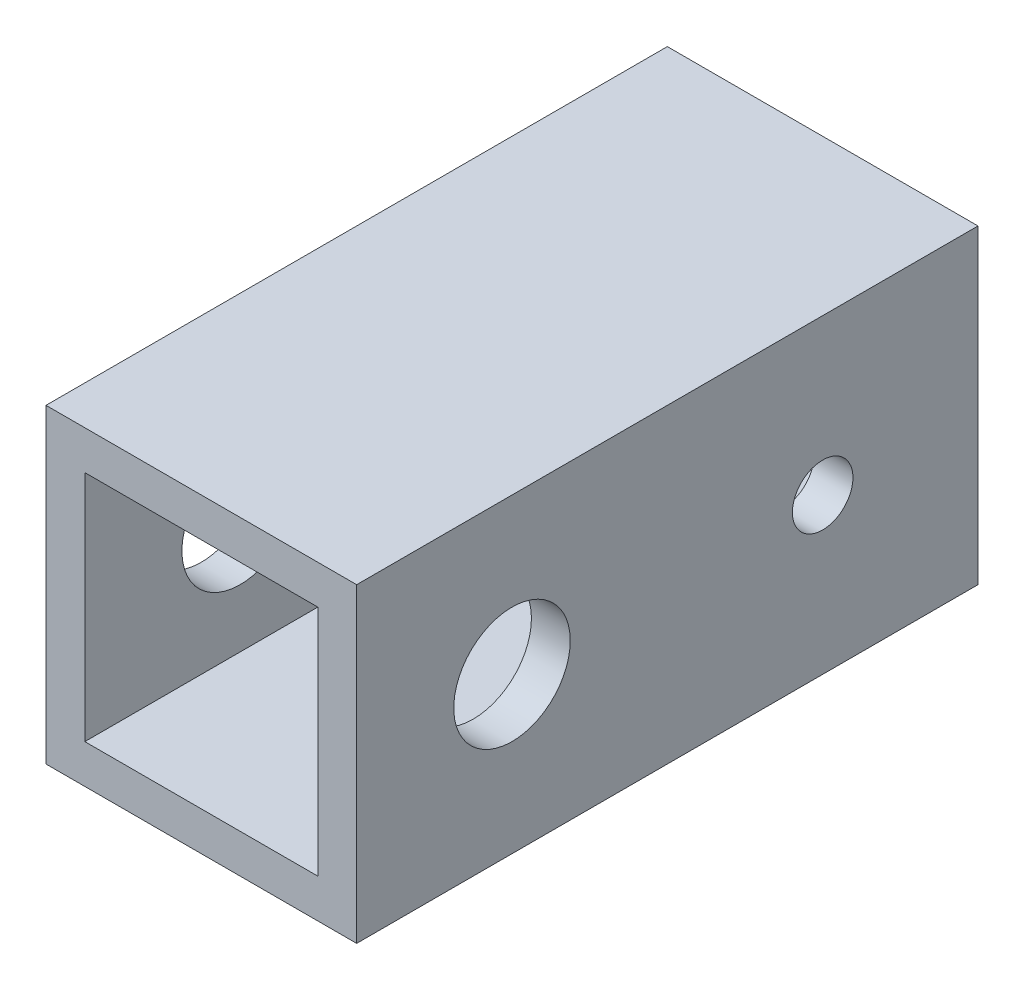
ISO-10303-21;
HEADER;
FILE_DESCRIPTION(('STEP AP214'),'2;1');
FILE_NAME('part.step','',(''),(''),'','','');
FILE_SCHEMA(('AUTOMOTIVE_DESIGN { 1 0 10303 214 1 1 1 1 }'));
ENDSEC;
DATA;
#1=APPLICATION_CONTEXT('core data for automotive mechanical design processes');
#2=APPLICATION_PROTOCOL_DEFINITION('international standard','automotive_design',2000,#1);
#3=PRODUCT_CONTEXT('',#1,'mechanical');
#4=PRODUCT('Part','Part','',(#3));
#5=PRODUCT_RELATED_PRODUCT_CATEGORY('part','',(#4));
#6=PRODUCT_DEFINITION_FORMATION('','',#4);
#7=PRODUCT_DEFINITION_CONTEXT('part definition',#1,'design');
#8=PRODUCT_DEFINITION('design','',#6,#7);
#9=PRODUCT_DEFINITION_SHAPE('','',#8);
#10=(LENGTH_UNIT() NAMED_UNIT(*) SI_UNIT(.MILLI.,.METRE.));
#11=(NAMED_UNIT(*) PLANE_ANGLE_UNIT() SI_UNIT($,.RADIAN.));
#12=(NAMED_UNIT(*) SI_UNIT($,.STERADIAN.) SOLID_ANGLE_UNIT());
#13=UNCERTAINTY_MEASURE_WITH_UNIT(LENGTH_MEASURE(1.E-05),#10,'distance_accuracy_value','');
#14=(GEOMETRIC_REPRESENTATION_CONTEXT(3) GLOBAL_UNCERTAINTY_ASSIGNED_CONTEXT((#13)) GLOBAL_UNIT_ASSIGNED_CONTEXT((#10,
#11,#12)) REPRESENTATION_CONTEXT('',''));
#15=CARTESIAN_POINT('',(0.,0.,0.));
#16=DIRECTION('',(0.,0.,1.));
#17=DIRECTION('',(1.,0.,0.));
#18=AXIS2_PLACEMENT_3D('',#15,#16,#17);
#19=CARTESIAN_POINT('',(0.,0.,50.8));
#20=DIRECTION('',(0.,0.,1.));
#21=DIRECTION('',(1.,0.,0.));
#22=AXIS2_PLACEMENT_3D('',#19,#20,#21);
#23=PLANE('',#22);
#24=DIRECTION('',(0.,1.,0.));
#25=VECTOR('',#24,1.);
#26=CARTESIAN_POINT('',(12.7,-12.7,50.8));
#27=LINE('',#26,#25);
#28=CARTESIAN_POINT('',(12.7,-12.7,50.8));
#29=VERTEX_POINT('',#28);
#30=CARTESIAN_POINT('',(12.7,12.7,50.8));
#31=VERTEX_POINT('',#30);
#32=EDGE_CURVE('E164',#29,#31,#27,.T.);
#33=ORIENTED_EDGE('',*,*,#32,.T.);
#34=DIRECTION('',(-1.,0.,0.));
#35=VECTOR('',#34,1.);
#36=CARTESIAN_POINT('',(-12.7,12.7,50.8));
#37=LINE('',#36,#35);
#38=CARTESIAN_POINT('',(-12.7,12.7,50.8));
#39=VERTEX_POINT('',#38);
#40=EDGE_CURVE('E167',#31,#39,#37,.T.);
#41=ORIENTED_EDGE('',*,*,#40,.T.);
#42=DIRECTION('',(0.,-1.,0.));
#43=VECTOR('',#42,1.);
#44=CARTESIAN_POINT('',(-12.7,-12.7,50.8));
#45=LINE('',#44,#43);
#46=CARTESIAN_POINT('',(-12.7,-12.7,50.8));
#47=VERTEX_POINT('',#46);
#48=EDGE_CURVE('E170',#39,#47,#45,.T.);
#49=ORIENTED_EDGE('',*,*,#48,.T.);
#50=DIRECTION('',(1.,0.,0.));
#51=VECTOR('',#50,1.);
#52=CARTESIAN_POINT('',(-12.7,-12.7,50.8));
#53=LINE('',#52,#51);
#54=EDGE_CURVE('E172',#47,#29,#53,.T.);
#55=ORIENTED_EDGE('',*,*,#54,.T.);
#56=EDGE_LOOP('',(#33,#41,#49,#55));
#57=FACE_BOUND('',#56,.T.);
#58=DIRECTION('',(-1.,0.,0.));
#59=VECTOR('',#58,1.);
#60=CARTESIAN_POINT('',(0.,9.525,50.8));
#61=LINE('',#60,#59);
#62=CARTESIAN_POINT('',(9.525,9.525,50.8));
#63=VERTEX_POINT('',#62);
#64=CARTESIAN_POINT('',(-9.525,9.525,50.8));
#65=VERTEX_POINT('',#64);
#66=EDGE_CURVE('E134',#63,#65,#61,.T.);
#67=ORIENTED_EDGE('',*,*,#66,.F.);
#68=DIRECTION('',(0.,1.,0.));
#69=VECTOR('',#68,1.);
#70=CARTESIAN_POINT('',(9.525,0.,50.8));
#71=LINE('',#70,#69);
#72=CARTESIAN_POINT('',(9.525,-9.525,50.8));
#73=VERTEX_POINT('',#72);
#74=EDGE_CURVE('E126',#73,#63,#71,.T.);
#75=ORIENTED_EDGE('',*,*,#74,.F.);
#76=DIRECTION('',(1.,0.,0.));
#77=VECTOR('',#76,1.);
#78=CARTESIAN_POINT('',(0.,-9.525,50.8));
#79=LINE('',#78,#77);
#80=CARTESIAN_POINT('',(-9.525,-9.525,50.8));
#81=VERTEX_POINT('',#80);
#82=EDGE_CURVE('E148',#81,#73,#79,.T.);
#83=ORIENTED_EDGE('',*,*,#82,.F.);
#84=DIRECTION('',(0.,-1.,0.));
#85=VECTOR('',#84,1.);
#86=CARTESIAN_POINT('',(-9.525,0.,50.8));
#87=LINE('',#86,#85);
#88=EDGE_CURVE('E146',#65,#81,#87,.T.);
#89=ORIENTED_EDGE('',*,*,#88,.F.);
#90=EDGE_LOOP('',(#67,#75,#83,#89));
#91=FACE_BOUND('',#90,.T.);
#92=ADVANCED_FACE('F59',(#57,#91),#23,.T.);
#93=CARTESIAN_POINT('',(0.,0.,0.));
#94=DIRECTION('',(0.,0.,1.));
#95=DIRECTION('',(1.,0.,0.));
#96=AXIS2_PLACEMENT_3D('',#93,#94,#95);
#97=PLANE('',#96);
#98=DIRECTION('',(0.,1.,0.));
#99=VECTOR('',#98,1.);
#100=CARTESIAN_POINT('',(12.7,-12.7,0.));
#101=LINE('',#100,#99);
#102=CARTESIAN_POINT('',(12.7,-12.7,0.));
#103=VERTEX_POINT('',#102);
#104=CARTESIAN_POINT('',(12.7,12.7,0.));
#105=VERTEX_POINT('',#104);
#106=EDGE_CURVE('E142',#103,#105,#101,.T.);
#107=ORIENTED_EDGE('',*,*,#106,.F.);
#108=DIRECTION('',(1.,0.,0.));
#109=VECTOR('',#108,1.);
#110=CARTESIAN_POINT('',(-12.7,-12.7,0.));
#111=LINE('',#110,#109);
#112=CARTESIAN_POINT('',(-12.7,-12.7,0.));
#113=VERTEX_POINT('',#112);
#114=EDGE_CURVE('E168',#113,#103,#111,.T.);
#115=ORIENTED_EDGE('',*,*,#114,.F.);
#116=DIRECTION('',(0.,-1.,0.));
#117=VECTOR('',#116,1.);
#118=CARTESIAN_POINT('',(-12.7,-12.7,0.));
#119=LINE('',#118,#117);
#120=CARTESIAN_POINT('',(-12.7,12.7,0.));
#121=VERTEX_POINT('',#120);
#122=EDGE_CURVE('E179',#121,#113,#119,.T.);
#123=ORIENTED_EDGE('',*,*,#122,.F.);
#124=DIRECTION('',(-1.,0.,0.));
#125=VECTOR('',#124,1.);
#126=CARTESIAN_POINT('',(-12.7,12.7,0.));
#127=LINE('',#126,#125);
#128=EDGE_CURVE('E177',#105,#121,#127,.T.);
#129=ORIENTED_EDGE('',*,*,#128,.F.);
#130=EDGE_LOOP('',(#107,#115,#123,#129));
#131=FACE_BOUND('',#130,.T.);
#132=DIRECTION('',(0.,1.,0.));
#133=VECTOR('',#132,1.);
#134=CARTESIAN_POINT('',(9.525,0.,0.));
#135=LINE('',#134,#133);
#136=CARTESIAN_POINT('',(9.525,-9.525,0.));
#137=VERTEX_POINT('',#136);
#138=CARTESIAN_POINT('',(9.525,9.525,0.));
#139=VERTEX_POINT('',#138);
#140=EDGE_CURVE('E84',#137,#139,#135,.T.);
#141=ORIENTED_EDGE('',*,*,#140,.T.);
#142=DIRECTION('',(-1.,0.,0.));
#143=VECTOR('',#142,1.);
#144=CARTESIAN_POINT('',(0.,9.525,0.));
#145=LINE('',#144,#143);
#146=CARTESIAN_POINT('',(-9.525,9.525,0.));
#147=VERTEX_POINT('',#146);
#148=EDGE_CURVE('E141',#139,#147,#145,.T.);
#149=ORIENTED_EDGE('',*,*,#148,.T.);
#150=DIRECTION('',(0.,-1.,0.));
#151=VECTOR('',#150,1.);
#152=CARTESIAN_POINT('',(-9.525,0.,0.));
#153=LINE('',#152,#151);
#154=CARTESIAN_POINT('',(-9.525,-9.525,0.));
#155=VERTEX_POINT('',#154);
#156=EDGE_CURVE('E156',#147,#155,#153,.T.);
#157=ORIENTED_EDGE('',*,*,#156,.T.);
#158=DIRECTION('',(1.,0.,0.));
#159=VECTOR('',#158,1.);
#160=CARTESIAN_POINT('',(0.,-9.525,0.));
#161=LINE('',#160,#159);
#162=EDGE_CURVE('E135',#155,#137,#161,.T.);
#163=ORIENTED_EDGE('',*,*,#162,.T.);
#164=EDGE_LOOP('',(#141,#149,#157,#163));
#165=FACE_BOUND('',#164,.T.);
#166=ADVANCED_FACE('F226',(#131,#165),#97,.F.);
#167=CARTESIAN_POINT('',(12.7,-12.7,50.8));
#168=DIRECTION('',(-1.,0.,0.));
#169=DIRECTION('',(0.,0.,1.));
#170=AXIS2_PLACEMENT_3D('',#167,#168,#169);
#171=PLANE('',#170);
#172=CARTESIAN_POINT('',(12.7,0.,38.1));
#173=DIRECTION('',(1.,0.,0.));
#174=DIRECTION('',(0.,0.,-1.));
#175=AXIS2_PLACEMENT_3D('',#172,#173,#174);
#176=CIRCLE('',#175,4.7625);
#177=CARTESIAN_POINT('',(12.7,0.,33.3375));
#178=VERTEX_POINT('',#177);
#179=EDGE_CURVE('E197',#178,#178,#176,.T.);
#180=ORIENTED_EDGE('',*,*,#179,.F.);
#181=EDGE_LOOP('',(#180));
#182=FACE_BOUND('',#181,.T.);
#183=CARTESIAN_POINT('',(12.7,0.,12.7));
#184=DIRECTION('',(1.,0.,0.));
#185=DIRECTION('',(0.,0.,-1.));
#186=AXIS2_PLACEMENT_3D('',#183,#184,#185);
#187=CIRCLE('',#186,2.4765);
#188=CARTESIAN_POINT('',(12.7,0.,10.2235));
#189=VERTEX_POINT('',#188);
#190=EDGE_CURVE('E207',#189,#189,#187,.T.);
#191=ORIENTED_EDGE('',*,*,#190,.F.);
#192=EDGE_LOOP('',(#191));
#193=FACE_BOUND('',#192,.T.);
#194=ORIENTED_EDGE('',*,*,#106,.T.);
#195=DIRECTION('',(0.,0.,-1.));
#196=VECTOR('',#195,1.);
#197=CARTESIAN_POINT('',(12.7,12.7,50.8));
#198=LINE('',#197,#196);
#199=EDGE_CURVE('E12',#31,#105,#198,.T.);
#200=ORIENTED_EDGE('',*,*,#199,.F.);
#201=ORIENTED_EDGE('',*,*,#32,.F.);
#202=DIRECTION('',(0.,0.,-1.));
#203=VECTOR('',#202,1.);
#204=CARTESIAN_POINT('',(12.7,-12.7,50.8));
#205=LINE('',#204,#203);
#206=EDGE_CURVE('E174',#29,#103,#205,.T.);
#207=ORIENTED_EDGE('',*,*,#206,.T.);
#208=EDGE_LOOP('',(#194,#200,#201,#207));
#209=FACE_BOUND('',#208,.T.);
#210=ADVANCED_FACE('F61',(#182,#193,#209),#171,.F.);
#211=CARTESIAN_POINT('',(-12.7,12.7,50.8));
#212=DIRECTION('',(0.,-1.,0.));
#213=DIRECTION('',(0.,0.,-1.));
#214=AXIS2_PLACEMENT_3D('',#211,#212,#213);
#215=PLANE('',#214);
#216=ORIENTED_EDGE('',*,*,#128,.T.);
#217=DIRECTION('',(0.,0.,-1.));
#218=VECTOR('',#217,1.);
#219=CARTESIAN_POINT('',(-12.7,12.7,50.8));
#220=LINE('',#219,#218);
#221=EDGE_CURVE('E68',#39,#121,#220,.T.);
#222=ORIENTED_EDGE('',*,*,#221,.F.);
#223=ORIENTED_EDGE('',*,*,#40,.F.);
#224=ORIENTED_EDGE('',*,*,#199,.T.);
#225=EDGE_LOOP('',(#216,#222,#223,#224));
#226=FACE_BOUND('',#225,.T.);
#227=ADVANCED_FACE('F252',(#226),#215,.F.);
#228=CARTESIAN_POINT('',(-12.7,-12.7,50.8));
#229=DIRECTION('',(1.,0.,0.));
#230=DIRECTION('',(0.,0.,-1.));
#231=AXIS2_PLACEMENT_3D('',#228,#229,#230);
#232=PLANE('',#231);
#233=CARTESIAN_POINT('',(-12.7,0.,38.1));
#234=DIRECTION('',(1.,0.,0.));
#235=DIRECTION('',(0.,0.,-1.));
#236=AXIS2_PLACEMENT_3D('',#233,#234,#235);
#237=CIRCLE('',#236,4.7625);
#238=CARTESIAN_POINT('',(-12.7,0.,33.3375));
#239=VERTEX_POINT('',#238);
#240=EDGE_CURVE('E191',#239,#239,#237,.T.);
#241=ORIENTED_EDGE('',*,*,#240,.T.);
#242=EDGE_LOOP('',(#241));
#243=FACE_BOUND('',#242,.T.);
#244=CARTESIAN_POINT('',(-12.7,0.,12.7));
#245=DIRECTION('',(1.,0.,0.));
#246=DIRECTION('',(0.,0.,-1.));
#247=AXIS2_PLACEMENT_3D('',#244,#245,#246);
#248=CIRCLE('',#247,2.4765);
#249=CARTESIAN_POINT('',(-12.7,0.,10.2235));
#250=VERTEX_POINT('',#249);
#251=EDGE_CURVE('E202',#250,#250,#248,.T.);
#252=ORIENTED_EDGE('',*,*,#251,.T.);
#253=EDGE_LOOP('',(#252));
#254=FACE_BOUND('',#253,.T.);
#255=ORIENTED_EDGE('',*,*,#122,.T.);
#256=DIRECTION('',(0.,0.,-1.));
#257=VECTOR('',#256,1.);
#258=CARTESIAN_POINT('',(-12.7,-12.7,50.8));
#259=LINE('',#258,#257);
#260=EDGE_CURVE('E184',#47,#113,#259,.T.);
#261=ORIENTED_EDGE('',*,*,#260,.F.);
#262=ORIENTED_EDGE('',*,*,#48,.F.);
#263=ORIENTED_EDGE('',*,*,#221,.T.);
#264=EDGE_LOOP('',(#255,#261,#262,#263));
#265=FACE_BOUND('',#264,.T.);
#266=ADVANCED_FACE('F249',(#243,#254,#265),#232,.F.);
#267=CARTESIAN_POINT('',(-12.7,-12.7,50.8));
#268=DIRECTION('',(0.,1.,0.));
#269=DIRECTION('',(0.,0.,1.));
#270=AXIS2_PLACEMENT_3D('',#267,#268,#269);
#271=PLANE('',#270);
#272=ORIENTED_EDGE('',*,*,#114,.T.);
#273=ORIENTED_EDGE('',*,*,#206,.F.);
#274=ORIENTED_EDGE('',*,*,#54,.F.);
#275=ORIENTED_EDGE('',*,*,#260,.T.);
#276=EDGE_LOOP('',(#272,#273,#274,#275));
#277=FACE_BOUND('',#276,.T.);
#278=ADVANCED_FACE('F246',(#277),#271,.F.);
#279=CARTESIAN_POINT('',(9.525,0.,50.8));
#280=DIRECTION('',(-1.,0.,0.));
#281=DIRECTION('',(0.,0.,1.));
#282=AXIS2_PLACEMENT_3D('',#279,#280,#281);
#283=PLANE('',#282);
#284=CARTESIAN_POINT('',(9.525,0.,38.1));
#285=DIRECTION('',(-1.,0.,0.));
#286=DIRECTION('',(0.,0.,1.));
#287=AXIS2_PLACEMENT_3D('',#284,#285,#286);
#288=CIRCLE('',#287,4.7625);
#289=CARTESIAN_POINT('',(9.525,0.,42.8625));
#290=VERTEX_POINT('',#289);
#291=EDGE_CURVE('E154',#290,#290,#288,.T.);
#292=ORIENTED_EDGE('',*,*,#291,.F.);
#293=EDGE_LOOP('',(#292));
#294=FACE_BOUND('',#293,.T.);
#295=CARTESIAN_POINT('',(9.525,0.,12.7));
#296=DIRECTION('',(-1.,0.,0.));
#297=DIRECTION('',(0.,0.,1.));
#298=AXIS2_PLACEMENT_3D('',#295,#296,#297);
#299=CIRCLE('',#298,2.4765);
#300=CARTESIAN_POINT('',(9.525,0.,15.1765));
#301=VERTEX_POINT('',#300);
#302=EDGE_CURVE('E190',#301,#301,#299,.T.);
#303=ORIENTED_EDGE('',*,*,#302,.F.);
#304=EDGE_LOOP('',(#303));
#305=FACE_BOUND('',#304,.T.);
#306=ORIENTED_EDGE('',*,*,#140,.F.);
#307=DIRECTION('',(0.,0.,-1.));
#308=VECTOR('',#307,1.);
#309=CARTESIAN_POINT('',(9.525,-9.525,50.8));
#310=LINE('',#309,#308);
#311=EDGE_CURVE('E130',#73,#137,#310,.T.);
#312=ORIENTED_EDGE('',*,*,#311,.F.);
#313=ORIENTED_EDGE('',*,*,#74,.T.);
#314=DIRECTION('',(0.,0.,-1.));
#315=VECTOR('',#314,1.);
#316=CARTESIAN_POINT('',(9.525,9.525,50.8));
#317=LINE('',#316,#315);
#318=EDGE_CURVE('E129',#63,#139,#317,.T.);
#319=ORIENTED_EDGE('',*,*,#318,.T.);
#320=EDGE_LOOP('',(#306,#312,#313,#319));
#321=FACE_BOUND('',#320,.T.);
#322=ADVANCED_FACE('F128',(#294,#305,#321),#283,.T.);
#323=CARTESIAN_POINT('',(0.,9.525,50.8));
#324=DIRECTION('',(0.,-1.,0.));
#325=DIRECTION('',(0.,0.,-1.));
#326=AXIS2_PLACEMENT_3D('',#323,#324,#325);
#327=PLANE('',#326);
#328=ORIENTED_EDGE('',*,*,#148,.F.);
#329=ORIENTED_EDGE('',*,*,#318,.F.);
#330=ORIENTED_EDGE('',*,*,#66,.T.);
#331=DIRECTION('',(0.,0.,-1.));
#332=VECTOR('',#331,1.);
#333=CARTESIAN_POINT('',(-9.525,9.525,50.8));
#334=LINE('',#333,#332);
#335=EDGE_CURVE('E143',#65,#147,#334,.T.);
#336=ORIENTED_EDGE('',*,*,#335,.T.);
#337=EDGE_LOOP('',(#328,#329,#330,#336));
#338=FACE_BOUND('',#337,.T.);
#339=ADVANCED_FACE('F138',(#338),#327,.T.);
#340=CARTESIAN_POINT('',(-9.525,0.,50.8));
#341=DIRECTION('',(1.,0.,0.));
#342=DIRECTION('',(0.,0.,-1.));
#343=AXIS2_PLACEMENT_3D('',#340,#341,#342);
#344=PLANE('',#343);
#345=CARTESIAN_POINT('',(-9.525,0.,38.1));
#346=DIRECTION('',(1.,0.,0.));
#347=DIRECTION('',(0.,0.,-1.));
#348=AXIS2_PLACEMENT_3D('',#345,#346,#347);
#349=CIRCLE('',#348,4.7625);
#350=CARTESIAN_POINT('',(-9.525,0.,33.3375));
#351=VERTEX_POINT('',#350);
#352=EDGE_CURVE('E63',#351,#351,#349,.T.);
#353=ORIENTED_EDGE('',*,*,#352,.F.);
#354=EDGE_LOOP('',(#353));
#355=FACE_BOUND('',#354,.T.);
#356=CARTESIAN_POINT('',(-9.525,0.,12.7));
#357=DIRECTION('',(1.,0.,0.));
#358=DIRECTION('',(0.,0.,-1.));
#359=AXIS2_PLACEMENT_3D('',#356,#357,#358);
#360=CIRCLE('',#359,2.4765);
#361=CARTESIAN_POINT('',(-9.525,0.,10.2235));
#362=VERTEX_POINT('',#361);
#363=EDGE_CURVE('E188',#362,#362,#360,.T.);
#364=ORIENTED_EDGE('',*,*,#363,.F.);
#365=EDGE_LOOP('',(#364));
#366=FACE_BOUND('',#365,.T.);
#367=ORIENTED_EDGE('',*,*,#156,.F.);
#368=ORIENTED_EDGE('',*,*,#335,.F.);
#369=ORIENTED_EDGE('',*,*,#88,.T.);
#370=DIRECTION('',(0.,0.,-1.));
#371=VECTOR('',#370,1.);
#372=CARTESIAN_POINT('',(-9.525,-9.525,50.8));
#373=LINE('',#372,#371);
#374=EDGE_CURVE('E76',#81,#155,#373,.T.);
#375=ORIENTED_EDGE('',*,*,#374,.T.);
#376=EDGE_LOOP('',(#367,#368,#369,#375));
#377=FACE_BOUND('',#376,.T.);
#378=ADVANCED_FACE('F218',(#355,#366,#377),#344,.T.);
#379=CARTESIAN_POINT('',(0.,-9.525,50.8));
#380=DIRECTION('',(0.,1.,0.));
#381=DIRECTION('',(0.,0.,1.));
#382=AXIS2_PLACEMENT_3D('',#379,#380,#381);
#383=PLANE('',#382);
#384=ORIENTED_EDGE('',*,*,#162,.F.);
#385=ORIENTED_EDGE('',*,*,#374,.F.);
#386=ORIENTED_EDGE('',*,*,#82,.T.);
#387=ORIENTED_EDGE('',*,*,#311,.T.);
#388=EDGE_LOOP('',(#384,#385,#386,#387));
#389=FACE_BOUND('',#388,.T.);
#390=ADVANCED_FACE('F221',(#389),#383,.T.);
#391=CARTESIAN_POINT('',(-12.7,0.,12.7));
#392=DIRECTION('',(1.,0.,0.));
#393=DIRECTION('',(0.,0.,-1.));
#394=AXIS2_PLACEMENT_3D('',#391,#392,#393);
#395=CYLINDRICAL_SURFACE('',#394,2.4765);
#396=ORIENTED_EDGE('',*,*,#363,.T.);
#397=EDGE_LOOP('',(#396));
#398=FACE_BOUND('',#397,.T.);
#399=ORIENTED_EDGE('',*,*,#251,.F.);
#400=EDGE_LOOP('',(#399));
#401=FACE_BOUND('',#400,.T.);
#402=ADVANCED_FACE('F228',(#398,#401),#395,.F.);
#403=CARTESIAN_POINT('',(-12.7,0.,38.1));
#404=DIRECTION('',(1.,0.,0.));
#405=DIRECTION('',(0.,0.,-1.));
#406=AXIS2_PLACEMENT_3D('',#403,#404,#405);
#407=CYLINDRICAL_SURFACE('',#406,4.7625);
#408=ORIENTED_EDGE('',*,*,#352,.T.);
#409=EDGE_LOOP('',(#408));
#410=FACE_BOUND('',#409,.T.);
#411=ORIENTED_EDGE('',*,*,#240,.F.);
#412=EDGE_LOOP('',(#411));
#413=FACE_BOUND('',#412,.T.);
#414=ADVANCED_FACE('F215',(#410,#413),#407,.F.);
#415=ORIENTED_EDGE('',*,*,#302,.T.);
#416=EDGE_LOOP('',(#415));
#417=FACE_BOUND('',#416,.T.);
#418=ORIENTED_EDGE('',*,*,#190,.T.);
#419=EDGE_LOOP('',(#418));
#420=FACE_BOUND('',#419,.T.);
#421=ADVANCED_FACE('F234',(#417,#420),#395,.F.);
#422=ORIENTED_EDGE('',*,*,#291,.T.);
#423=EDGE_LOOP('',(#422));
#424=FACE_BOUND('',#423,.T.);
#425=ORIENTED_EDGE('',*,*,#179,.T.);
#426=EDGE_LOOP('',(#425));
#427=FACE_BOUND('',#426,.T.);
#428=ADVANCED_FACE('F278',(#424,#427),#407,.F.);
#429=CLOSED_SHELL('',(#92,#166,#210,#227,#266,#278,#322,#339,#378,#390,#402,#414,#421,#428));
#430=MANIFOLD_SOLID_BREP('B2',#429);
#431=ADVANCED_BREP_SHAPE_REPRESENTATION('',(#18,#430),#14);
#432=SHAPE_DEFINITION_REPRESENTATION(#9,#431);
ENDSEC;
END-ISO-10303-21;
